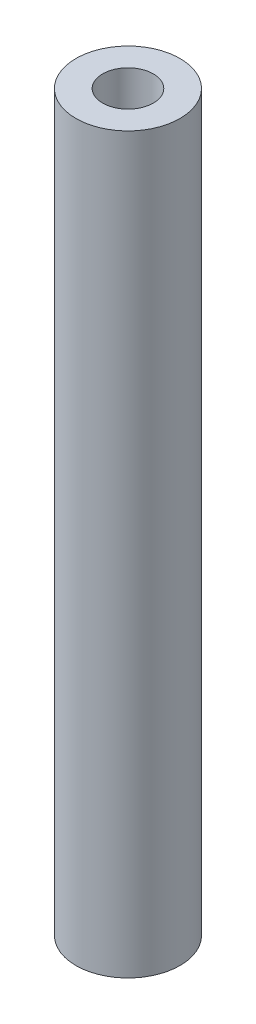
ISO-10303-21;
HEADER;
FILE_DESCRIPTION(('STEP AP214'),'2;1');
FILE_NAME('part.step','',(''),(''),'','','');
FILE_SCHEMA(('AUTOMOTIVE_DESIGN { 1 0 10303 214 1 1 1 1 }'));
ENDSEC;
DATA;
#1=APPLICATION_CONTEXT('core data for automotive mechanical design processes');
#2=APPLICATION_PROTOCOL_DEFINITION('international standard','automotive_design',2000,#1);
#3=PRODUCT_CONTEXT('',#1,'mechanical');
#4=PRODUCT('Part','Part','',(#3));
#5=PRODUCT_RELATED_PRODUCT_CATEGORY('part','',(#4));
#6=PRODUCT_DEFINITION_FORMATION('','',#4);
#7=PRODUCT_DEFINITION_CONTEXT('part definition',#1,'design');
#8=PRODUCT_DEFINITION('design','',#6,#7);
#9=PRODUCT_DEFINITION_SHAPE('','',#8);
#10=(LENGTH_UNIT() NAMED_UNIT(*) SI_UNIT(.MILLI.,.METRE.));
#11=(NAMED_UNIT(*) PLANE_ANGLE_UNIT() SI_UNIT($,.RADIAN.));
#12=(NAMED_UNIT(*) SI_UNIT($,.STERADIAN.) SOLID_ANGLE_UNIT());
#13=UNCERTAINTY_MEASURE_WITH_UNIT(LENGTH_MEASURE(1.E-05),#10,'distance_accuracy_value','');
#14=(GEOMETRIC_REPRESENTATION_CONTEXT(3) GLOBAL_UNCERTAINTY_ASSIGNED_CONTEXT((#13)) GLOBAL_UNIT_ASSIGNED_CONTEXT((#10,
#11,#12)) REPRESENTATION_CONTEXT('',''));
#15=CARTESIAN_POINT('',(0.,0.,0.));
#16=DIRECTION('',(0.,0.,1.));
#17=DIRECTION('',(1.,0.,0.));
#18=AXIS2_PLACEMENT_3D('',#15,#16,#17);
#19=CARTESIAN_POINT('',(0.,55.,0.));
#20=DIRECTION('',(0.,1.,0.));
#21=DIRECTION('',(0.,0.,1.));
#22=AXIS2_PLACEMENT_3D('',#19,#20,#21);
#23=PLANE('',#22);
#24=CARTESIAN_POINT('',(0.,55.,0.));
#25=DIRECTION('',(0.,1.,0.));
#26=DIRECTION('',(0.,0.,1.));
#27=AXIS2_PLACEMENT_3D('',#24,#25,#26);
#28=CIRCLE('',#27,3.9);
#29=CARTESIAN_POINT('',(0.,55.,3.9));
#30=VERTEX_POINT('',#29);
#31=EDGE_CURVE('E10',#30,#30,#28,.T.);
#32=ORIENTED_EDGE('',*,*,#31,.T.);
#33=EDGE_LOOP('',(#32));
#34=FACE_BOUND('',#33,.T.);
#35=CARTESIAN_POINT('',(0.,55.,0.));
#36=DIRECTION('',(0.,1.,0.));
#37=DIRECTION('',(0.,0.,1.));
#38=AXIS2_PLACEMENT_3D('',#35,#36,#37);
#39=CIRCLE('',#38,1.9);
#40=CARTESIAN_POINT('',(0.,55.,1.9));
#41=VERTEX_POINT('',#40);
#42=EDGE_CURVE('E54',#41,#41,#39,.T.);
#43=ORIENTED_EDGE('',*,*,#42,.F.);
#44=EDGE_LOOP('',(#43));
#45=FACE_BOUND('',#44,.T.);
#46=ADVANCED_FACE('F41',(#34,#45),#23,.T.);
#47=CARTESIAN_POINT('',(0.,0.,0.));
#48=DIRECTION('',(0.,1.,0.));
#49=DIRECTION('',(0.,0.,1.));
#50=AXIS2_PLACEMENT_3D('',#47,#48,#49);
#51=PLANE('',#50);
#52=CARTESIAN_POINT('',(0.,0.,0.));
#53=DIRECTION('',(0.,1.,0.));
#54=DIRECTION('',(0.,0.,1.));
#55=AXIS2_PLACEMENT_3D('',#52,#53,#54);
#56=CIRCLE('',#55,3.9);
#57=CARTESIAN_POINT('',(0.,0.,3.9));
#58=VERTEX_POINT('',#57);
#59=EDGE_CURVE('E45',#58,#58,#56,.T.);
#60=ORIENTED_EDGE('',*,*,#59,.F.);
#61=EDGE_LOOP('',(#60));
#62=FACE_BOUND('',#61,.T.);
#63=CARTESIAN_POINT('',(0.,0.,0.));
#64=DIRECTION('',(0.,1.,0.));
#65=DIRECTION('',(0.,0.,1.));
#66=AXIS2_PLACEMENT_3D('',#63,#64,#65);
#67=CIRCLE('',#66,1.9);
#68=CARTESIAN_POINT('',(0.,0.,1.9));
#69=VERTEX_POINT('',#68);
#70=EDGE_CURVE('E56',#69,#69,#67,.T.);
#71=ORIENTED_EDGE('',*,*,#70,.T.);
#72=EDGE_LOOP('',(#71));
#73=FACE_BOUND('',#72,.T.);
#74=ADVANCED_FACE('F68',(#62,#73),#51,.F.);
#75=CARTESIAN_POINT('',(0.,55.,0.));
#76=DIRECTION('',(0.,-1.,0.));
#77=DIRECTION('',(0.,0.,-1.));
#78=AXIS2_PLACEMENT_3D('',#75,#76,#77);
#79=CYLINDRICAL_SURFACE('',#78,3.9);
#80=ORIENTED_EDGE('',*,*,#31,.F.);
#81=EDGE_LOOP('',(#80));
#82=FACE_BOUND('',#81,.T.);
#83=ORIENTED_EDGE('',*,*,#59,.T.);
#84=EDGE_LOOP('',(#83));
#85=FACE_BOUND('',#84,.T.);
#86=ADVANCED_FACE('F43',(#82,#85),#79,.T.);
#87=CARTESIAN_POINT('',(0.,55.,0.));
#88=DIRECTION('',(0.,-1.,0.));
#89=DIRECTION('',(0.,0.,-1.));
#90=AXIS2_PLACEMENT_3D('',#87,#88,#89);
#91=CYLINDRICAL_SURFACE('',#90,1.9);
#92=ORIENTED_EDGE('',*,*,#42,.T.);
#93=EDGE_LOOP('',(#92));
#94=FACE_BOUND('',#93,.T.);
#95=ORIENTED_EDGE('',*,*,#70,.F.);
#96=EDGE_LOOP('',(#95));
#97=FACE_BOUND('',#96,.T.);
#98=ADVANCED_FACE('F64',(#94,#97),#91,.F.);
#99=CLOSED_SHELL('',(#46,#74,#86,#98));
#100=MANIFOLD_SOLID_BREP('B2',#99);
#101=ADVANCED_BREP_SHAPE_REPRESENTATION('',(#18,#100),#14);
#102=SHAPE_DEFINITION_REPRESENTATION(#9,#101);
ENDSEC;
END-ISO-10303-21;
